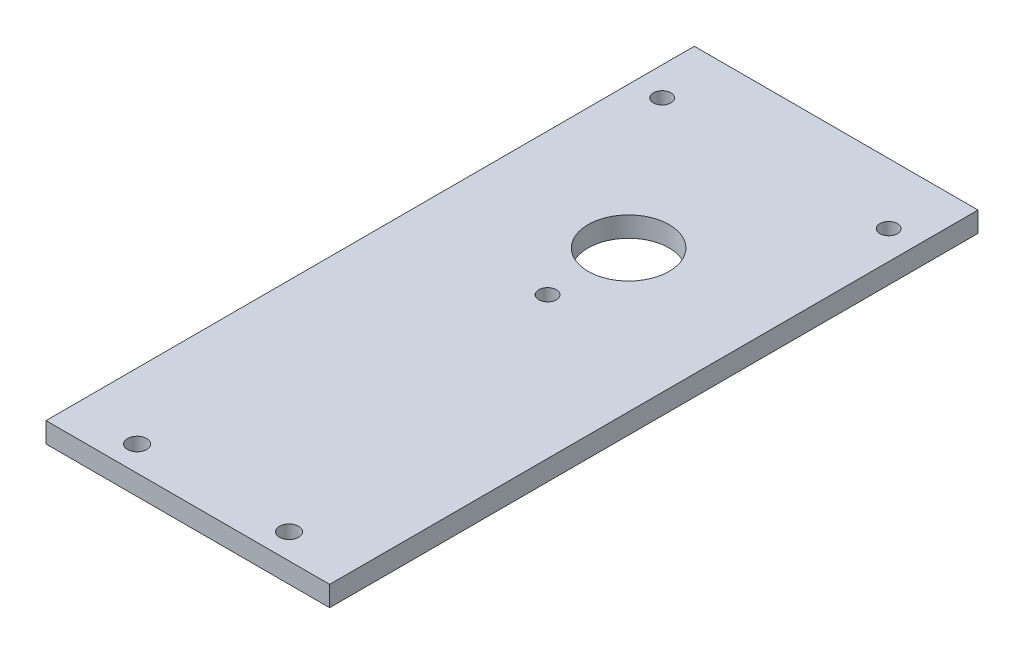
ISO-10303-21;
HEADER;
FILE_DESCRIPTION(('STEP AP214'),'2;1');
FILE_NAME('part.step','',(''),(''),'','','');
FILE_SCHEMA(('AUTOMOTIVE_DESIGN { 1 0 10303 214 1 1 1 1 }'));
ENDSEC;
DATA;
#1=APPLICATION_CONTEXT('core data for automotive mechanical design processes');
#2=APPLICATION_PROTOCOL_DEFINITION('international standard','automotive_design',2000,#1);
#3=PRODUCT_CONTEXT('',#1,'mechanical');
#4=PRODUCT('Part','Part','',(#3));
#5=PRODUCT_RELATED_PRODUCT_CATEGORY('part','',(#4));
#6=PRODUCT_DEFINITION_FORMATION('','',#4);
#7=PRODUCT_DEFINITION_CONTEXT('part definition',#1,'design');
#8=PRODUCT_DEFINITION('design','',#6,#7);
#9=PRODUCT_DEFINITION_SHAPE('','',#8);
#10=(LENGTH_UNIT() NAMED_UNIT(*) SI_UNIT(.MILLI.,.METRE.));
#11=(NAMED_UNIT(*) PLANE_ANGLE_UNIT() SI_UNIT($,.RADIAN.));
#12=(NAMED_UNIT(*) SI_UNIT($,.STERADIAN.) SOLID_ANGLE_UNIT());
#13=UNCERTAINTY_MEASURE_WITH_UNIT(LENGTH_MEASURE(1.E-05),#10,'distance_accuracy_value','');
#14=(GEOMETRIC_REPRESENTATION_CONTEXT(3) GLOBAL_UNCERTAINTY_ASSIGNED_CONTEXT((#13)) GLOBAL_UNIT_ASSIGNED_CONTEXT((#10,
#11,#12)) REPRESENTATION_CONTEXT('',''));
#15=CARTESIAN_POINT('',(0.,0.,0.));
#16=DIRECTION('',(0.,0.,1.));
#17=DIRECTION('',(1.,0.,0.));
#18=AXIS2_PLACEMENT_3D('',#15,#16,#17);
#19=CARTESIAN_POINT('',(0.,6.35,0.));
#20=DIRECTION('',(1.,0.,0.));
#21=DIRECTION('',(0.,0.,-1.));
#22=AXIS2_PLACEMENT_3D('',#19,#20,#21);
#23=PLANE('',#22);
#24=DIRECTION('',(0.,0.,1.));
#25=VECTOR('',#24,1.);
#26=CARTESIAN_POINT('',(0.,0.,0.));
#27=LINE('',#26,#25);
#28=CARTESIAN_POINT('',(0.,0.,-203.2));
#29=VERTEX_POINT('',#28);
#30=CARTESIAN_POINT('',(0.,0.,0.));
#31=VERTEX_POINT('',#30);
#32=EDGE_CURVE('E95',#29,#31,#27,.T.);
#33=ORIENTED_EDGE('',*,*,#32,.T.);
#34=DIRECTION('',(0.,-1.,0.));
#35=VECTOR('',#34,1.);
#36=CARTESIAN_POINT('',(0.,6.35,0.));
#37=LINE('',#36,#35);
#38=CARTESIAN_POINT('',(0.,6.35,0.));
#39=VERTEX_POINT('',#38);
#40=EDGE_CURVE('E11',#39,#31,#37,.T.);
#41=ORIENTED_EDGE('',*,*,#40,.F.);
#42=DIRECTION('',(0.,0.,1.));
#43=VECTOR('',#42,1.);
#44=CARTESIAN_POINT('',(0.,6.35,0.));
#45=LINE('',#44,#43);
#46=CARTESIAN_POINT('',(0.,6.35,-203.2));
#47=VERTEX_POINT('',#46);
#48=EDGE_CURVE('E83',#47,#39,#45,.T.);
#49=ORIENTED_EDGE('',*,*,#48,.F.);
#50=DIRECTION('',(0.,-1.,0.));
#51=VECTOR('',#50,1.);
#52=CARTESIAN_POINT('',(0.,6.35,-203.2));
#53=LINE('',#52,#51);
#54=EDGE_CURVE('E91',#47,#29,#53,.T.);
#55=ORIENTED_EDGE('',*,*,#54,.T.);
#56=EDGE_LOOP('',(#33,#41,#49,#55));
#57=FACE_BOUND('',#56,.T.);
#58=ADVANCED_FACE('F32',(#57),#23,.F.);
#59=CARTESIAN_POINT('',(0.,6.35,0.));
#60=DIRECTION('',(0.,0.,-1.));
#61=DIRECTION('',(-1.,0.,0.));
#62=AXIS2_PLACEMENT_3D('',#59,#60,#61);
#63=PLANE('',#62);
#64=DIRECTION('',(1.,0.,0.));
#65=VECTOR('',#64,1.);
#66=CARTESIAN_POINT('',(0.,0.,0.));
#67=LINE('',#66,#65);
#68=CARTESIAN_POINT('',(88.9,0.,0.));
#69=VERTEX_POINT('',#68);
#70=EDGE_CURVE('E87',#31,#69,#67,.T.);
#71=ORIENTED_EDGE('',*,*,#70,.T.);
#72=DIRECTION('',(0.,-1.,0.));
#73=VECTOR('',#72,1.);
#74=CARTESIAN_POINT('',(88.9,6.35,0.));
#75=LINE('',#74,#73);
#76=CARTESIAN_POINT('',(88.9,6.35,0.));
#77=VERTEX_POINT('',#76);
#78=EDGE_CURVE('E40',#77,#69,#75,.T.);
#79=ORIENTED_EDGE('',*,*,#78,.F.);
#80=DIRECTION('',(1.,0.,0.));
#81=VECTOR('',#80,1.);
#82=CARTESIAN_POINT('',(0.,6.35,0.));
#83=LINE('',#82,#81);
#84=EDGE_CURVE('E78',#39,#77,#83,.T.);
#85=ORIENTED_EDGE('',*,*,#84,.F.);
#86=ORIENTED_EDGE('',*,*,#40,.T.);
#87=EDGE_LOOP('',(#71,#79,#85,#86));
#88=FACE_BOUND('',#87,.T.);
#89=ADVANCED_FACE('F86',(#88),#63,.F.);
#90=CARTESIAN_POINT('',(88.9,6.35,0.));
#91=DIRECTION('',(-1.,0.,0.));
#92=DIRECTION('',(0.,0.,1.));
#93=AXIS2_PLACEMENT_3D('',#90,#91,#92);
#94=PLANE('',#93);
#95=DIRECTION('',(0.,0.,-1.));
#96=VECTOR('',#95,1.);
#97=CARTESIAN_POINT('',(88.9,0.,0.));
#98=LINE('',#97,#96);
#99=CARTESIAN_POINT('',(88.9,0.,-203.2));
#100=VERTEX_POINT('',#99);
#101=EDGE_CURVE('E65',#69,#100,#98,.T.);
#102=ORIENTED_EDGE('',*,*,#101,.T.);
#103=DIRECTION('',(0.,-1.,0.));
#104=VECTOR('',#103,1.);
#105=CARTESIAN_POINT('',(88.9,6.35,-203.2));
#106=LINE('',#105,#104);
#107=CARTESIAN_POINT('',(88.9,6.35,-203.2));
#108=VERTEX_POINT('',#107);
#109=EDGE_CURVE('E88',#108,#100,#106,.T.);
#110=ORIENTED_EDGE('',*,*,#109,.F.);
#111=DIRECTION('',(0.,0.,-1.));
#112=VECTOR('',#111,1.);
#113=CARTESIAN_POINT('',(88.9,6.35,0.));
#114=LINE('',#113,#112);
#115=EDGE_CURVE('E81',#77,#108,#114,.T.);
#116=ORIENTED_EDGE('',*,*,#115,.F.);
#117=ORIENTED_EDGE('',*,*,#78,.T.);
#118=EDGE_LOOP('',(#102,#110,#116,#117));
#119=FACE_BOUND('',#118,.T.);
#120=ADVANCED_FACE('F89',(#119),#94,.F.);
#121=CARTESIAN_POINT('',(0.,6.35,-203.2));
#122=DIRECTION('',(0.,0.,1.));
#123=DIRECTION('',(1.,0.,0.));
#124=AXIS2_PLACEMENT_3D('',#121,#122,#123);
#125=PLANE('',#124);
#126=DIRECTION('',(-1.,0.,0.));
#127=VECTOR('',#126,1.);
#128=CARTESIAN_POINT('',(0.,0.,-203.2));
#129=LINE('',#128,#127);
#130=EDGE_CURVE('E71',#100,#29,#129,.T.);
#131=ORIENTED_EDGE('',*,*,#130,.T.);
#132=ORIENTED_EDGE('',*,*,#54,.F.);
#133=DIRECTION('',(-1.,0.,0.));
#134=VECTOR('',#133,1.);
#135=CARTESIAN_POINT('',(0.,6.35,-203.2));
#136=LINE('',#135,#134);
#137=EDGE_CURVE('E48',#108,#47,#136,.T.);
#138=ORIENTED_EDGE('',*,*,#137,.F.);
#139=ORIENTED_EDGE('',*,*,#109,.T.);
#140=EDGE_LOOP('',(#131,#132,#138,#139));
#141=FACE_BOUND('',#140,.T.);
#142=ADVANCED_FACE('F103',(#141),#125,.F.);
#143=CARTESIAN_POINT('',(0.,6.35,0.));
#144=DIRECTION('',(0.,-1.,0.));
#145=DIRECTION('',(0.,0.,-1.));
#146=AXIS2_PLACEMENT_3D('',#143,#144,#145);
#147=PLANE('',#146);
#148=CARTESIAN_POINT('',(68.2624999999994,6.35,-7.91354444225355));
#149=DIRECTION('',(0.,-1.,0.));
#150=DIRECTION('',(0.,0.,-1.));
#151=AXIS2_PLACEMENT_3D('',#148,#149,#150);
#152=CIRCLE('',#151,3.00000000000001);
#153=CARTESIAN_POINT('',(68.2624999999994,6.35,-10.9135444422536));
#154=VERTEX_POINT('',#153);
#155=EDGE_CURVE('E112',#154,#154,#152,.T.);
#156=ORIENTED_EDGE('',*,*,#155,.T.);
#157=EDGE_LOOP('',(#156));
#158=FACE_BOUND('',#157,.T.);
#159=CARTESIAN_POINT('',(44.45,6.35,-112.75));
#160=DIRECTION('',(0.,-1.,0.));
#161=DIRECTION('',(0.,0.,-1.));
#162=AXIS2_PLACEMENT_3D('',#159,#160,#161);
#163=CIRCLE('',#162,2.75);
#164=CARTESIAN_POINT('',(44.45,6.35,-115.5));
#165=VERTEX_POINT('',#164);
#166=EDGE_CURVE('E136',#165,#165,#163,.T.);
#167=ORIENTED_EDGE('',*,*,#166,.T.);
#168=EDGE_LOOP('',(#167));
#169=FACE_BOUND('',#168,.T.);
#170=CARTESIAN_POINT('',(8.95,6.35,-184.15));
#171=DIRECTION('',(0.,-1.,0.));
#172=DIRECTION('',(0.,0.,-1.));
#173=AXIS2_PLACEMENT_3D('',#170,#171,#172);
#174=CIRCLE('',#173,2.75);
#175=CARTESIAN_POINT('',(8.95,6.35,-186.9));
#176=VERTEX_POINT('',#175);
#177=EDGE_CURVE('E130',#176,#176,#174,.T.);
#178=ORIENTED_EDGE('',*,*,#177,.T.);
#179=EDGE_LOOP('',(#178));
#180=FACE_BOUND('',#179,.T.);
#181=CARTESIAN_POINT('',(79.95,6.35,-184.15));
#182=DIRECTION('',(0.,-1.,0.));
#183=DIRECTION('',(0.,0.,-1.));
#184=AXIS2_PLACEMENT_3D('',#181,#182,#183);
#185=CIRCLE('',#184,2.75000000000001);
#186=CARTESIAN_POINT('',(79.95,6.35,-186.9));
#187=VERTEX_POINT('',#186);
#188=EDGE_CURVE('E124',#187,#187,#185,.T.);
#189=ORIENTED_EDGE('',*,*,#188,.T.);
#190=EDGE_LOOP('',(#189));
#191=FACE_BOUND('',#190,.T.);
#192=CARTESIAN_POINT('',(44.45,6.35,-138.15));
#193=DIRECTION('',(0.,-1.,0.));
#194=DIRECTION('',(0.,0.,-1.));
#195=AXIS2_PLACEMENT_3D('',#192,#193,#194);
#196=CIRCLE('',#195,12.7);
#197=CARTESIAN_POINT('',(44.45,6.35,-150.85));
#198=VERTEX_POINT('',#197);
#199=EDGE_CURVE('E118',#198,#198,#196,.T.);
#200=ORIENTED_EDGE('',*,*,#199,.T.);
#201=EDGE_LOOP('',(#200));
#202=FACE_BOUND('',#201,.T.);
#203=CARTESIAN_POINT('',(20.6374999999994,6.35,-7.91354444225355));
#204=DIRECTION('',(0.,-1.,0.));
#205=DIRECTION('',(0.,0.,-1.));
#206=AXIS2_PLACEMENT_3D('',#203,#204,#205);
#207=CIRCLE('',#206,3.);
#208=CARTESIAN_POINT('',(20.6374999999994,6.35,-10.9135444422535));
#209=VERTEX_POINT('',#208);
#210=EDGE_CURVE('E98',#209,#209,#207,.T.);
#211=ORIENTED_EDGE('',*,*,#210,.T.);
#212=EDGE_LOOP('',(#211));
#213=FACE_BOUND('',#212,.T.);
#214=ORIENTED_EDGE('',*,*,#48,.T.);
#215=ORIENTED_EDGE('',*,*,#84,.T.);
#216=ORIENTED_EDGE('',*,*,#115,.T.);
#217=ORIENTED_EDGE('',*,*,#137,.T.);
#218=EDGE_LOOP('',(#214,#215,#216,#217));
#219=FACE_BOUND('',#218,.T.);
#220=ADVANCED_FACE('F79',(#158,#169,#180,#191,#202,#213,#219),#147,.F.);
#221=CARTESIAN_POINT('',(0.,0.,0.));
#222=DIRECTION('',(0.,-1.,0.));
#223=DIRECTION('',(0.,0.,-1.));
#224=AXIS2_PLACEMENT_3D('',#221,#222,#223);
#225=PLANE('',#224);
#226=CARTESIAN_POINT('',(68.2624999999994,0.,-7.91354444225355));
#227=DIRECTION('',(0.,-1.,0.));
#228=DIRECTION('',(0.,0.,-1.));
#229=AXIS2_PLACEMENT_3D('',#226,#227,#228);
#230=CIRCLE('',#229,3.00000000000001);
#231=CARTESIAN_POINT('',(68.2624999999994,0.,-10.9135444422536));
#232=VERTEX_POINT('',#231);
#233=EDGE_CURVE('E139',#232,#232,#230,.T.);
#234=ORIENTED_EDGE('',*,*,#233,.F.);
#235=EDGE_LOOP('',(#234));
#236=FACE_BOUND('',#235,.T.);
#237=CARTESIAN_POINT('',(44.45,0.,-112.75));
#238=DIRECTION('',(0.,-1.,0.));
#239=DIRECTION('',(0.,0.,-1.));
#240=AXIS2_PLACEMENT_3D('',#237,#238,#239);
#241=CIRCLE('',#240,2.75);
#242=CARTESIAN_POINT('',(44.45,0.,-115.5));
#243=VERTEX_POINT('',#242);
#244=EDGE_CURVE('E133',#243,#243,#241,.T.);
#245=ORIENTED_EDGE('',*,*,#244,.F.);
#246=EDGE_LOOP('',(#245));
#247=FACE_BOUND('',#246,.T.);
#248=CARTESIAN_POINT('',(8.95,0.,-184.15));
#249=DIRECTION('',(0.,-1.,0.));
#250=DIRECTION('',(0.,0.,-1.));
#251=AXIS2_PLACEMENT_3D('',#248,#249,#250);
#252=CIRCLE('',#251,2.75);
#253=CARTESIAN_POINT('',(8.95,0.,-186.9));
#254=VERTEX_POINT('',#253);
#255=EDGE_CURVE('E127',#254,#254,#252,.T.);
#256=ORIENTED_EDGE('',*,*,#255,.F.);
#257=EDGE_LOOP('',(#256));
#258=FACE_BOUND('',#257,.T.);
#259=CARTESIAN_POINT('',(79.95,0.,-184.15));
#260=DIRECTION('',(0.,-1.,0.));
#261=DIRECTION('',(0.,0.,-1.));
#262=AXIS2_PLACEMENT_3D('',#259,#260,#261);
#263=CIRCLE('',#262,2.75000000000001);
#264=CARTESIAN_POINT('',(79.95,0.,-186.9));
#265=VERTEX_POINT('',#264);
#266=EDGE_CURVE('E121',#265,#265,#263,.T.);
#267=ORIENTED_EDGE('',*,*,#266,.F.);
#268=EDGE_LOOP('',(#267));
#269=FACE_BOUND('',#268,.T.);
#270=CARTESIAN_POINT('',(44.45,0.,-138.15));
#271=DIRECTION('',(0.,-1.,0.));
#272=DIRECTION('',(0.,0.,-1.));
#273=AXIS2_PLACEMENT_3D('',#270,#271,#272);
#274=CIRCLE('',#273,12.7);
#275=CARTESIAN_POINT('',(44.45,0.,-150.85));
#276=VERTEX_POINT('',#275);
#277=EDGE_CURVE('E115',#276,#276,#274,.T.);
#278=ORIENTED_EDGE('',*,*,#277,.F.);
#279=EDGE_LOOP('',(#278));
#280=FACE_BOUND('',#279,.T.);
#281=CARTESIAN_POINT('',(20.6374999999994,0.,-7.91354444225355));
#282=DIRECTION('',(0.,-1.,0.));
#283=DIRECTION('',(0.,0.,-1.));
#284=AXIS2_PLACEMENT_3D('',#281,#282,#283);
#285=CIRCLE('',#284,3.);
#286=CARTESIAN_POINT('',(20.6374999999994,0.,-10.9135444422535));
#287=VERTEX_POINT('',#286);
#288=EDGE_CURVE('E109',#287,#287,#285,.T.);
#289=ORIENTED_EDGE('',*,*,#288,.F.);
#290=EDGE_LOOP('',(#289));
#291=FACE_BOUND('',#290,.T.);
#292=ORIENTED_EDGE('',*,*,#32,.F.);
#293=ORIENTED_EDGE('',*,*,#130,.F.);
#294=ORIENTED_EDGE('',*,*,#101,.F.);
#295=ORIENTED_EDGE('',*,*,#70,.F.);
#296=EDGE_LOOP('',(#292,#293,#294,#295));
#297=FACE_BOUND('',#296,.T.);
#298=ADVANCED_FACE('F106',(#236,#247,#258,#269,#280,#291,#297),#225,.T.);
#299=CARTESIAN_POINT('',(20.6374999999994,6.35,-7.91354444225355));
#300=DIRECTION('',(0.,-1.,0.));
#301=DIRECTION('',(0.,0.,-1.));
#302=AXIS2_PLACEMENT_3D('',#299,#300,#301);
#303=CYLINDRICAL_SURFACE('',#302,3.);
#304=ORIENTED_EDGE('',*,*,#210,.F.);
#305=EDGE_LOOP('',(#304));
#306=FACE_BOUND('',#305,.T.);
#307=ORIENTED_EDGE('',*,*,#288,.T.);
#308=EDGE_LOOP('',(#307));
#309=FACE_BOUND('',#308,.T.);
#310=ADVANCED_FACE('F156',(#306,#309),#303,.F.);
#311=CARTESIAN_POINT('',(44.45,6.35,-138.15));
#312=DIRECTION('',(0.,-1.,0.));
#313=DIRECTION('',(0.,0.,-1.));
#314=AXIS2_PLACEMENT_3D('',#311,#312,#313);
#315=CYLINDRICAL_SURFACE('',#314,12.7);
#316=ORIENTED_EDGE('',*,*,#199,.F.);
#317=EDGE_LOOP('',(#316));
#318=FACE_BOUND('',#317,.T.);
#319=ORIENTED_EDGE('',*,*,#277,.T.);
#320=EDGE_LOOP('',(#319));
#321=FACE_BOUND('',#320,.T.);
#322=ADVANCED_FACE('F169',(#318,#321),#315,.F.);
#323=CARTESIAN_POINT('',(79.95,6.35,-184.15));
#324=DIRECTION('',(0.,-1.,0.));
#325=DIRECTION('',(0.,0.,-1.));
#326=AXIS2_PLACEMENT_3D('',#323,#324,#325);
#327=CYLINDRICAL_SURFACE('',#326,2.75000000000001);
#328=ORIENTED_EDGE('',*,*,#188,.F.);
#329=EDGE_LOOP('',(#328));
#330=FACE_BOUND('',#329,.T.);
#331=ORIENTED_EDGE('',*,*,#266,.T.);
#332=EDGE_LOOP('',(#331));
#333=FACE_BOUND('',#332,.T.);
#334=ADVANCED_FACE('F175',(#330,#333),#327,.F.);
#335=CARTESIAN_POINT('',(8.95,6.35,-184.15));
#336=DIRECTION('',(0.,-1.,0.));
#337=DIRECTION('',(0.,0.,-1.));
#338=AXIS2_PLACEMENT_3D('',#335,#336,#337);
#339=CYLINDRICAL_SURFACE('',#338,2.75);
#340=ORIENTED_EDGE('',*,*,#177,.F.);
#341=EDGE_LOOP('',(#340));
#342=FACE_BOUND('',#341,.T.);
#343=ORIENTED_EDGE('',*,*,#255,.T.);
#344=EDGE_LOOP('',(#343));
#345=FACE_BOUND('',#344,.T.);
#346=ADVANCED_FACE('F218',(#342,#345),#339,.F.);
#347=CARTESIAN_POINT('',(44.45,6.35,-112.75));
#348=DIRECTION('',(0.,-1.,0.));
#349=DIRECTION('',(0.,0.,-1.));
#350=AXIS2_PLACEMENT_3D('',#347,#348,#349);
#351=CYLINDRICAL_SURFACE('',#350,2.75);
#352=ORIENTED_EDGE('',*,*,#166,.F.);
#353=EDGE_LOOP('',(#352));
#354=FACE_BOUND('',#353,.T.);
#355=ORIENTED_EDGE('',*,*,#244,.T.);
#356=EDGE_LOOP('',(#355));
#357=FACE_BOUND('',#356,.T.);
#358=ADVANCED_FACE('F150',(#354,#357),#351,.F.);
#359=CARTESIAN_POINT('',(68.2624999999994,6.35,-7.91354444225355));
#360=DIRECTION('',(0.,-1.,0.));
#361=DIRECTION('',(0.,0.,-1.));
#362=AXIS2_PLACEMENT_3D('',#359,#360,#361);
#363=CYLINDRICAL_SURFACE('',#362,3.00000000000001);
#364=ORIENTED_EDGE('',*,*,#155,.F.);
#365=EDGE_LOOP('',(#364));
#366=FACE_BOUND('',#365,.T.);
#367=ORIENTED_EDGE('',*,*,#233,.T.);
#368=EDGE_LOOP('',(#367));
#369=FACE_BOUND('',#368,.T.);
#370=ADVANCED_FACE('F147',(#366,#369),#363,.F.);
#371=CLOSED_SHELL('',(#58,#89,#120,#142,#220,#298,#310,#322,#334,#346,#358,#370));
#372=MANIFOLD_SOLID_BREP('B2',#371);
#373=ADVANCED_BREP_SHAPE_REPRESENTATION('',(#18,#372),#14);
#374=SHAPE_DEFINITION_REPRESENTATION(#9,#373);
ENDSEC;
END-ISO-10303-21;
